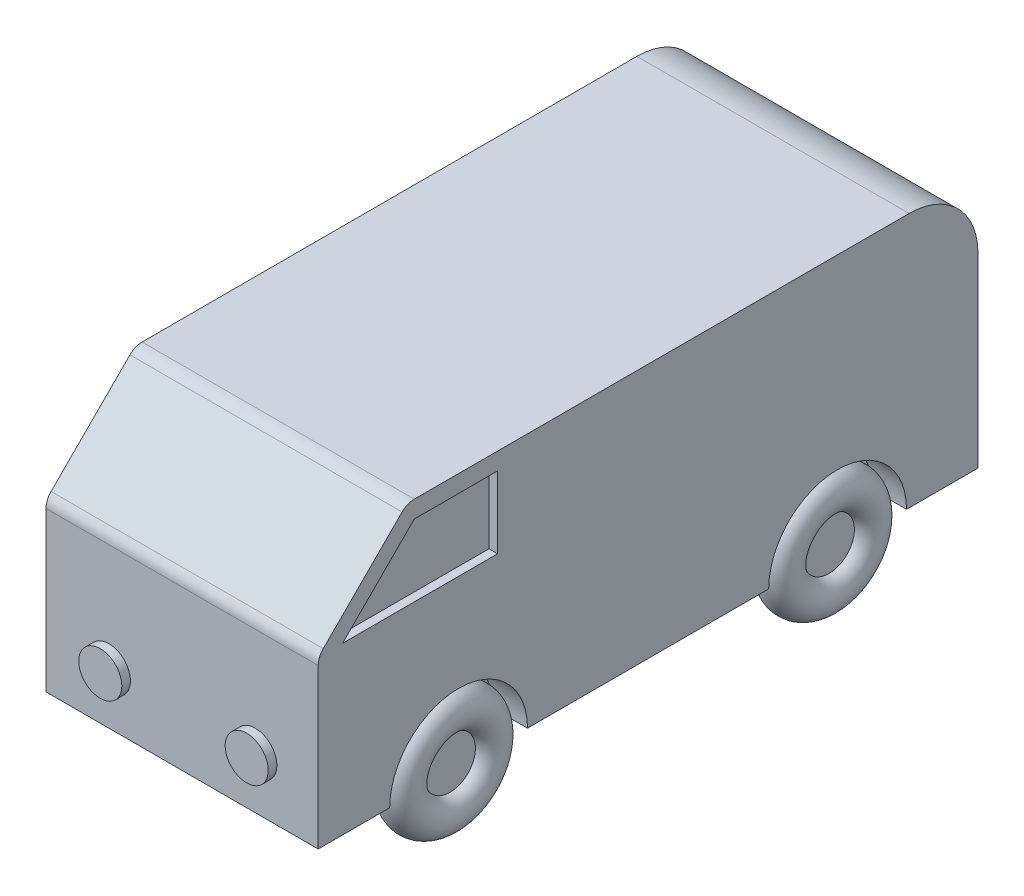
ISO-10303-21;
HEADER;
FILE_DESCRIPTION(('STEP AP214'),'2;1');
FILE_NAME('part.step','',(''),(''),'','','');
FILE_SCHEMA(('AUTOMOTIVE_DESIGN { 1 0 10303 214 1 1 1 1 }'));
ENDSEC;
DATA;
#1=APPLICATION_CONTEXT('core data for automotive mechanical design processes');
#2=APPLICATION_PROTOCOL_DEFINITION('international standard','automotive_design',2000,#1);
#3=PRODUCT_CONTEXT('',#1,'mechanical');
#4=PRODUCT('Part','Part','',(#3));
#5=PRODUCT_RELATED_PRODUCT_CATEGORY('part','',(#4));
#6=PRODUCT_DEFINITION_FORMATION('','',#4);
#7=PRODUCT_DEFINITION_CONTEXT('part definition',#1,'design');
#8=PRODUCT_DEFINITION('design','',#6,#7);
#9=PRODUCT_DEFINITION_SHAPE('','',#8);
#10=(LENGTH_UNIT() NAMED_UNIT(*) SI_UNIT(.MILLI.,.METRE.));
#11=(NAMED_UNIT(*) PLANE_ANGLE_UNIT() SI_UNIT($,.RADIAN.));
#12=(NAMED_UNIT(*) SI_UNIT($,.STERADIAN.) SOLID_ANGLE_UNIT());
#13=UNCERTAINTY_MEASURE_WITH_UNIT(LENGTH_MEASURE(1.E-05),#10,'distance_accuracy_value','');
#14=(GEOMETRIC_REPRESENTATION_CONTEXT(3) GLOBAL_UNCERTAINTY_ASSIGNED_CONTEXT((#13)) GLOBAL_UNIT_ASSIGNED_CONTEXT((#10,
#11,#12)) REPRESENTATION_CONTEXT('',''));
#15=CARTESIAN_POINT('',(0.,0.,0.));
#16=DIRECTION('',(0.,0.,1.));
#17=DIRECTION('',(1.,0.,0.));
#18=AXIS2_PLACEMENT_3D('',#15,#16,#17);
#19=CARTESIAN_POINT('',(79.,108.,-151.5));
#20=DIRECTION('',(1.,0.,0.));
#21=DIRECTION('',(0.,0.,-1.));
#22=AXIS2_PLACEMENT_3D('',#19,#20,#21);
#23=PLANE('',#22);
#24=DIRECTION('',(0.,0.,1.));
#25=VECTOR('',#24,1.);
#26=CARTESIAN_POINT('',(79.,148.,-151.5));
#27=LINE('',#26,#25);
#28=CARTESIAN_POINT('',(79.,148.,-151.5));
#29=VERTEX_POINT('',#28);
#30=CARTESIAN_POINT('',(79.,148.,135.717864376269));
#31=VERTEX_POINT('',#30);
#32=EDGE_CURVE('E381',#29,#31,#27,.T.);
#33=ORIENTED_EDGE('',*,*,#32,.T.);
#34=CARTESIAN_POINT('',(79.,138.,135.717864376269));
#35=DIRECTION('',(1.,0.,0.));
#36=DIRECTION('',(0.,0.,-1.));
#37=AXIS2_PLACEMENT_3D('',#34,#35,#36);
#38=CIRCLE('',#37,10.);
#39=CARTESIAN_POINT('',(79.,145.071067811865,142.788932188134));
#40=VERTEX_POINT('',#39);
#41=EDGE_CURVE('E13',#31,#40,#38,.T.);
#42=ORIENTED_EDGE('',*,*,#41,.T.);
#43=DIRECTION('',(0.,0.707106781186544,-0.707106781186551));
#44=VECTOR('',#43,1.);
#45=CARTESIAN_POINT('',(79.,96.36,191.5));
#46=LINE('',#45,#44);
#47=CARTESIAN_POINT('',(79.,99.2889321881346,188.571067811865));
#48=VERTEX_POINT('',#47);
#49=EDGE_CURVE('E383',#48,#40,#46,.T.);
#50=ORIENTED_EDGE('',*,*,#49,.F.);
#51=CARTESIAN_POINT('',(79.,92.217864376269,181.5));
#52=DIRECTION('',(1.,0.,0.));
#53=DIRECTION('',(0.,0.,-1.));
#54=AXIS2_PLACEMENT_3D('',#51,#52,#53);
#55=CIRCLE('',#54,10.);
#56=CARTESIAN_POINT('',(79.,92.217864376269,191.5));
#57=VERTEX_POINT('',#56);
#58=EDGE_CURVE('E444',#48,#57,#55,.T.);
#59=ORIENTED_EDGE('',*,*,#58,.T.);
#60=DIRECTION('',(0.,-1.,0.));
#61=VECTOR('',#60,1.);
#62=CARTESIAN_POINT('',(79.,96.36,191.5));
#63=LINE('',#62,#61);
#64=CARTESIAN_POINT('',(79.,0.,191.5));
#65=VERTEX_POINT('',#64);
#66=EDGE_CURVE('E369',#57,#65,#63,.T.);
#67=ORIENTED_EDGE('',*,*,#66,.T.);
#68=DIRECTION('',(0.,0.,-1.));
#69=VECTOR('',#68,1.);
#70=CARTESIAN_POINT('',(79.,0.,191.5));
#71=LINE('',#70,#69);
#72=CARTESIAN_POINT('',(79.,0.,150.));
#73=VERTEX_POINT('',#72);
#74=EDGE_CURVE('E373',#65,#73,#71,.T.);
#75=ORIENTED_EDGE('',*,*,#74,.T.);
#76=CARTESIAN_POINT('',(79.,0.,110.));
#77=DIRECTION('',(-1.,0.,0.));
#78=DIRECTION('',(0.,0.,1.));
#79=AXIS2_PLACEMENT_3D('',#76,#77,#78);
#80=CIRCLE('',#79,40.);
#81=CARTESIAN_POINT('',(79.,0.,70.));
#82=VERTEX_POINT('',#81);
#83=EDGE_CURVE('E320',#73,#82,#80,.T.);
#84=ORIENTED_EDGE('',*,*,#83,.T.);
#85=CARTESIAN_POINT('',(79.,0.,-70.));
#86=VERTEX_POINT('',#85);
#87=EDGE_CURVE('E377',#82,#86,#71,.T.);
#88=ORIENTED_EDGE('',*,*,#87,.T.);
#89=CARTESIAN_POINT('',(79.,0.,-110.));
#90=DIRECTION('',(-1.,0.,0.));
#91=DIRECTION('',(0.,0.,1.));
#92=AXIS2_PLACEMENT_3D('',#89,#90,#91);
#93=CIRCLE('',#92,40.);
#94=CARTESIAN_POINT('',(79.,0.,-150.));
#95=VERTEX_POINT('',#94);
#96=EDGE_CURVE('E325',#86,#95,#93,.T.);
#97=ORIENTED_EDGE('',*,*,#96,.T.);
#98=CARTESIAN_POINT('',(79.,0.,-191.5));
#99=VERTEX_POINT('',#98);
#100=EDGE_CURVE('E371',#95,#99,#71,.T.);
#101=ORIENTED_EDGE('',*,*,#100,.T.);
#102=DIRECTION('',(0.,1.,0.));
#103=VECTOR('',#102,1.);
#104=CARTESIAN_POINT('',(79.,0.,-191.5));
#105=LINE('',#104,#103);
#106=CARTESIAN_POINT('',(79.,108.,-191.5));
#107=VERTEX_POINT('',#106);
#108=EDGE_CURVE('E376',#99,#107,#105,.T.);
#109=ORIENTED_EDGE('',*,*,#108,.T.);
#110=CARTESIAN_POINT('',(79.,108.,-151.5));
#111=DIRECTION('',(1.,0.,0.));
#112=DIRECTION('',(0.,0.,-1.));
#113=AXIS2_PLACEMENT_3D('',#110,#111,#112);
#114=CIRCLE('',#113,40.);
#115=EDGE_CURVE('E379',#107,#29,#114,.T.);
#116=ORIENTED_EDGE('',*,*,#115,.T.);
#117=EDGE_LOOP('',(#33,#42,#50,#59,#67,#75,#84,#88,#97,#101,#109,#116));
#118=FACE_BOUND('',#117,.T.);
#119=DIRECTION('',(0.,0.,-1.));
#120=VECTOR('',#119,1.);
#121=CARTESIAN_POINT('',(79.,138.,135.717864376269));
#122=LINE('',#121,#120);
#123=CARTESIAN_POINT('',(79.,138.,135.717864376269));
#124=VERTEX_POINT('',#123);
#125=CARTESIAN_POINT('',(79.,138.,87.3578643762691));
#126=VERTEX_POINT('',#125);
#127=EDGE_CURVE('E249',#124,#126,#122,.T.);
#128=ORIENTED_EDGE('',*,*,#127,.T.);
#129=DIRECTION('',(0.,-1.,0.));
#130=VECTOR('',#129,1.);
#131=CARTESIAN_POINT('',(79.,138.,87.3578643762691));
#132=LINE('',#131,#130);
#133=CARTESIAN_POINT('',(79.,96.36,87.3578643762691));
#134=VERTEX_POINT('',#133);
#135=EDGE_CURVE('E967',#126,#134,#132,.T.);
#136=ORIENTED_EDGE('',*,*,#135,.T.);
#137=DIRECTION('',(0.,0.,1.));
#138=VECTOR('',#137,1.);
#139=CARTESIAN_POINT('',(79.,96.36,87.3578643762691));
#140=LINE('',#139,#138);
#141=CARTESIAN_POINT('',(79.,96.36,177.357864376269));
#142=VERTEX_POINT('',#141);
#143=EDGE_CURVE('E253',#134,#142,#140,.T.);
#144=ORIENTED_EDGE('',*,*,#143,.T.);
#145=DIRECTION('',(0.,0.707106781186547,-0.707106781186548));
#146=VECTOR('',#145,1.);
#147=CARTESIAN_POINT('',(79.,96.36,177.357864376269));
#148=LINE('',#147,#146);
#149=EDGE_CURVE('E962',#142,#124,#148,.T.);
#150=ORIENTED_EDGE('',*,*,#149,.T.);
#151=EDGE_LOOP('',(#128,#136,#144,#150));
#152=FACE_BOUND('',#151,.T.);
#153=ADVANCED_FACE('F46',(#118,#152),#23,.T.);
#154=CARTESIAN_POINT('',(79.,0.,0.));
#155=DIRECTION('',(0.,1.,0.));
#156=DIRECTION('',(0.,0.,1.));
#157=AXIS2_PLACEMENT_3D('',#154,#155,#156);
#158=PLANE('',#157);
#159=DIRECTION('',(1.,0.,0.));
#160=VECTOR('',#159,1.);
#161=CARTESIAN_POINT('',(59.,0.,-70.));
#162=LINE('',#161,#160);
#163=CARTESIAN_POINT('',(59.,0.,-70.));
#164=VERTEX_POINT('',#163);
#165=EDGE_CURVE('E338',#86,#164,#162,.F.);
#166=ORIENTED_EDGE('',*,*,#165,.F.);
#167=ORIENTED_EDGE('',*,*,#87,.F.);
#168=DIRECTION('',(1.,0.,0.));
#169=VECTOR('',#168,1.);
#170=CARTESIAN_POINT('',(59.,0.,70.));
#171=LINE('',#170,#169);
#172=CARTESIAN_POINT('',(59.,0.,70.));
#173=VERTEX_POINT('',#172);
#174=EDGE_CURVE('E324',#173,#82,#171,.T.);
#175=ORIENTED_EDGE('',*,*,#174,.F.);
#176=DIRECTION('',(0.,0.,-1.));
#177=VECTOR('',#176,1.);
#178=CARTESIAN_POINT('',(59.,0.,0.));
#179=LINE('',#178,#177);
#180=CARTESIAN_POINT('',(59.,0.,85.));
#181=VERTEX_POINT('',#180);
#182=EDGE_CURVE('E426',#181,#173,#179,.T.);
#183=ORIENTED_EDGE('',*,*,#182,.F.);
#184=CARTESIAN_POINT('',(59.,0.,135.));
#185=VERTEX_POINT('',#184);
#186=EDGE_CURVE('E432',#185,#181,#179,.T.);
#187=ORIENTED_EDGE('',*,*,#186,.F.);
#188=CARTESIAN_POINT('',(59.,0.,150.));
#189=VERTEX_POINT('',#188);
#190=EDGE_CURVE('E428',#189,#185,#179,.T.);
#191=ORIENTED_EDGE('',*,*,#190,.F.);
#192=DIRECTION('',(1.,0.,0.));
#193=VECTOR('',#192,1.);
#194=CARTESIAN_POINT('',(59.,0.,150.));
#195=LINE('',#194,#193);
#196=EDGE_CURVE('E334',#73,#189,#195,.F.);
#197=ORIENTED_EDGE('',*,*,#196,.F.);
#198=ORIENTED_EDGE('',*,*,#74,.F.);
#199=DIRECTION('',(-1.,0.,0.));
#200=VECTOR('',#199,1.);
#201=CARTESIAN_POINT('',(79.,0.,191.5));
#202=LINE('',#201,#200);
#203=CARTESIAN_POINT('',(-79.,0.,191.5));
#204=VERTEX_POINT('',#203);
#205=EDGE_CURVE('E408',#65,#204,#202,.T.);
#206=ORIENTED_EDGE('',*,*,#205,.T.);
#207=DIRECTION('',(0.,0.,-1.));
#208=VECTOR('',#207,1.);
#209=CARTESIAN_POINT('',(-79.,0.,0.));
#210=LINE('',#209,#208);
#211=CARTESIAN_POINT('',(-79.,0.,150.));
#212=VERTEX_POINT('',#211);
#213=EDGE_CURVE('E389',#204,#212,#210,.T.);
#214=ORIENTED_EDGE('',*,*,#213,.T.);
#215=DIRECTION('',(-1.,0.,0.));
#216=VECTOR('',#215,1.);
#217=CARTESIAN_POINT('',(-59.,0.,150.));
#218=LINE('',#217,#216);
#219=CARTESIAN_POINT('',(-59.,0.,150.));
#220=VERTEX_POINT('',#219);
#221=EDGE_CURVE('E344',#212,#220,#218,.F.);
#222=ORIENTED_EDGE('',*,*,#221,.T.);
#223=DIRECTION('',(0.,0.,1.));
#224=VECTOR('',#223,1.);
#225=CARTESIAN_POINT('',(-59.,0.,0.));
#226=LINE('',#225,#224);
#227=CARTESIAN_POINT('',(-59.,0.,135.));
#228=VERTEX_POINT('',#227);
#229=EDGE_CURVE('E417',#228,#220,#226,.T.);
#230=ORIENTED_EDGE('',*,*,#229,.F.);
#231=CARTESIAN_POINT('',(-59.,0.,85.));
#232=VERTEX_POINT('',#231);
#233=EDGE_CURVE('E422',#232,#228,#226,.T.);
#234=ORIENTED_EDGE('',*,*,#233,.F.);
#235=CARTESIAN_POINT('',(-59.,0.,70.));
#236=VERTEX_POINT('',#235);
#237=EDGE_CURVE('E418',#236,#232,#226,.T.);
#238=ORIENTED_EDGE('',*,*,#237,.F.);
#239=DIRECTION('',(-1.,0.,0.));
#240=VECTOR('',#239,1.);
#241=CARTESIAN_POINT('',(-59.,0.,70.));
#242=LINE('',#241,#240);
#243=CARTESIAN_POINT('',(-79.,0.,70.));
#244=VERTEX_POINT('',#243);
#245=EDGE_CURVE('E353',#236,#244,#242,.T.);
#246=ORIENTED_EDGE('',*,*,#245,.T.);
#247=CARTESIAN_POINT('',(-79.,0.,-70.));
#248=VERTEX_POINT('',#247);
#249=EDGE_CURVE('E393',#244,#248,#210,.T.);
#250=ORIENTED_EDGE('',*,*,#249,.T.);
#251=DIRECTION('',(-1.,0.,0.));
#252=VECTOR('',#251,1.);
#253=CARTESIAN_POINT('',(-59.,0.,-70.));
#254=LINE('',#253,#252);
#255=CARTESIAN_POINT('',(-59.,0.,-70.));
#256=VERTEX_POINT('',#255);
#257=EDGE_CURVE('E356',#248,#256,#254,.F.);
#258=ORIENTED_EDGE('',*,*,#257,.T.);
#259=DIRECTION('',(0.,0.,1.));
#260=VECTOR('',#259,1.);
#261=CARTESIAN_POINT('',(-59.,0.,0.));
#262=LINE('',#261,#260);
#263=CARTESIAN_POINT('',(-59.,0.,-85.));
#264=VERTEX_POINT('',#263);
#265=EDGE_CURVE('E421',#264,#256,#262,.T.);
#266=ORIENTED_EDGE('',*,*,#265,.F.);
#267=CARTESIAN_POINT('',(-59.,0.,-135.));
#268=VERTEX_POINT('',#267);
#269=EDGE_CURVE('E427',#268,#264,#262,.T.);
#270=ORIENTED_EDGE('',*,*,#269,.F.);
#271=CARTESIAN_POINT('',(-59.,0.,-150.));
#272=VERTEX_POINT('',#271);
#273=EDGE_CURVE('E423',#272,#268,#262,.T.);
#274=ORIENTED_EDGE('',*,*,#273,.F.);
#275=DIRECTION('',(-1.,0.,0.));
#276=VECTOR('',#275,1.);
#277=CARTESIAN_POINT('',(-59.,0.,-150.));
#278=LINE('',#277,#276);
#279=CARTESIAN_POINT('',(-79.,0.,-150.));
#280=VERTEX_POINT('',#279);
#281=EDGE_CURVE('E359',#272,#280,#278,.T.);
#282=ORIENTED_EDGE('',*,*,#281,.T.);
#283=CARTESIAN_POINT('',(-79.,0.,-191.5));
#284=VERTEX_POINT('',#283);
#285=EDGE_CURVE('E388',#280,#284,#210,.T.);
#286=ORIENTED_EDGE('',*,*,#285,.T.);
#287=DIRECTION('',(-1.,0.,0.));
#288=VECTOR('',#287,1.);
#289=CARTESIAN_POINT('',(79.,0.,-191.5));
#290=LINE('',#289,#288);
#291=EDGE_CURVE('E405',#99,#284,#290,.T.);
#292=ORIENTED_EDGE('',*,*,#291,.F.);
#293=ORIENTED_EDGE('',*,*,#100,.F.);
#294=DIRECTION('',(1.,0.,0.));
#295=VECTOR('',#294,1.);
#296=CARTESIAN_POINT('',(59.,0.,-150.));
#297=LINE('',#296,#295);
#298=CARTESIAN_POINT('',(59.,0.,-150.));
#299=VERTEX_POINT('',#298);
#300=EDGE_CURVE('E336',#299,#95,#297,.T.);
#301=ORIENTED_EDGE('',*,*,#300,.F.);
#302=DIRECTION('',(0.,0.,-1.));
#303=VECTOR('',#302,1.);
#304=CARTESIAN_POINT('',(59.,0.,0.));
#305=LINE('',#304,#303);
#306=CARTESIAN_POINT('',(59.,0.,-135.));
#307=VERTEX_POINT('',#306);
#308=EDGE_CURVE('E431',#307,#299,#305,.T.);
#309=ORIENTED_EDGE('',*,*,#308,.F.);
#310=CARTESIAN_POINT('',(59.,0.,-85.));
#311=VERTEX_POINT('',#310);
#312=EDGE_CURVE('E437',#311,#307,#305,.T.);
#313=ORIENTED_EDGE('',*,*,#312,.F.);
#314=EDGE_CURVE('E433',#164,#311,#305,.T.);
#315=ORIENTED_EDGE('',*,*,#314,.F.);
#316=EDGE_LOOP('',(#166,#167,#175,#183,#187,#191,#197,#198,#206,#214,#222,#230,#234,#238,#246,
#250,#258,#266,#270,#274,#282,#286,#292,#293,#301,#309,#313,#315));
#317=FACE_BOUND('',#316,.T.);
#318=ADVANCED_FACE('F474',(#317),#158,.F.);
#319=CARTESIAN_POINT('',(79.,96.36,191.5));
#320=DIRECTION('',(0.,0.,-1.));
#321=DIRECTION('',(0.,1.,0.));
#322=AXIS2_PLACEMENT_3D('',#319,#320,#321);
#323=PLANE('',#322);
#324=CARTESIAN_POINT('',(42.5,30.,191.5));
#325=DIRECTION('',(0.,0.,-1.));
#326=DIRECTION('',(0.,1.,0.));
#327=AXIS2_PLACEMENT_3D('',#324,#325,#326);
#328=CIRCLE('',#327,12.5);
#329=CARTESIAN_POINT('',(42.5,42.5,191.5));
#330=VERTEX_POINT('',#329);
#331=EDGE_CURVE('E414',#330,#330,#328,.F.);
#332=ORIENTED_EDGE('',*,*,#331,.F.);
#333=EDGE_LOOP('',(#332));
#334=FACE_BOUND('',#333,.T.);
#335=CARTESIAN_POINT('',(-42.5,30.,191.5));
#336=DIRECTION('',(0.,0.,-1.));
#337=DIRECTION('',(0.,1.,0.));
#338=AXIS2_PLACEMENT_3D('',#335,#336,#337);
#339=CIRCLE('',#338,12.5);
#340=CARTESIAN_POINT('',(-42.5,42.5,191.5));
#341=VERTEX_POINT('',#340);
#342=EDGE_CURVE('E411',#341,#341,#339,.F.);
#343=ORIENTED_EDGE('',*,*,#342,.F.);
#344=EDGE_LOOP('',(#343));
#345=FACE_BOUND('',#344,.T.);
#346=ORIENTED_EDGE('',*,*,#66,.F.);
#347=DIRECTION('',(-1.,0.,0.));
#348=VECTOR('',#347,1.);
#349=CARTESIAN_POINT('',(-79.,92.217864376269,191.5));
#350=LINE('',#349,#348);
#351=CARTESIAN_POINT('',(-79.,92.217864376269,191.5));
#352=VERTEX_POINT('',#351);
#353=EDGE_CURVE('E436',#57,#352,#350,.T.);
#354=ORIENTED_EDGE('',*,*,#353,.T.);
#355=DIRECTION('',(0.,-1.,0.));
#356=VECTOR('',#355,1.);
#357=CARTESIAN_POINT('',(-79.,96.36,191.5));
#358=LINE('',#357,#356);
#359=EDGE_CURVE('E368',#352,#204,#358,.T.);
#360=ORIENTED_EDGE('',*,*,#359,.T.);
#361=ORIENTED_EDGE('',*,*,#205,.F.);
#362=EDGE_LOOP('',(#346,#354,#360,#361));
#363=FACE_BOUND('',#362,.T.);
#364=ADVANCED_FACE('F466',(#334,#345,#363),#323,.F.);
#365=CARTESIAN_POINT('',(79.,0.,-191.5));
#366=DIRECTION('',(0.,0.,1.));
#367=DIRECTION('',(0.,-1.,0.));
#368=AXIS2_PLACEMENT_3D('',#365,#366,#367);
#369=PLANE('',#368);
#370=DIRECTION('',(0.,1.,0.));
#371=VECTOR('',#370,1.);
#372=CARTESIAN_POINT('',(-79.,0.,-191.5));
#373=LINE('',#372,#371);
#374=CARTESIAN_POINT('',(-79.,108.,-191.5));
#375=VERTEX_POINT('',#374);
#376=EDGE_CURVE('E392',#284,#375,#373,.T.);
#377=ORIENTED_EDGE('',*,*,#376,.T.);
#378=DIRECTION('',(-1.,0.,0.));
#379=VECTOR('',#378,1.);
#380=CARTESIAN_POINT('',(79.,108.,-191.5));
#381=LINE('',#380,#379);
#382=EDGE_CURVE('E402',#107,#375,#381,.T.);
#383=ORIENTED_EDGE('',*,*,#382,.F.);
#384=ORIENTED_EDGE('',*,*,#108,.F.);
#385=ORIENTED_EDGE('',*,*,#291,.T.);
#386=EDGE_LOOP('',(#377,#383,#384,#385));
#387=FACE_BOUND('',#386,.T.);
#388=ADVANCED_FACE('F524',(#387),#369,.F.);
#389=CARTESIAN_POINT('',(79.,108.,-151.5));
#390=DIRECTION('',(-1.,0.,0.));
#391=DIRECTION('',(0.,0.,1.));
#392=AXIS2_PLACEMENT_3D('',#389,#390,#391);
#393=CYLINDRICAL_SURFACE('',#392,40.);
#394=CARTESIAN_POINT('',(-79.,108.,-151.5));
#395=DIRECTION('',(1.,0.,0.));
#396=DIRECTION('',(0.,0.,-1.));
#397=AXIS2_PLACEMENT_3D('',#394,#395,#396);
#398=CIRCLE('',#397,40.);
#399=CARTESIAN_POINT('',(-79.,148.,-151.5));
#400=VERTEX_POINT('',#399);
#401=EDGE_CURVE('E395',#375,#400,#398,.T.);
#402=ORIENTED_EDGE('',*,*,#401,.T.);
#403=DIRECTION('',(-1.,0.,0.));
#404=VECTOR('',#403,1.);
#405=CARTESIAN_POINT('',(79.,148.,-151.5));
#406=LINE('',#405,#404);
#407=EDGE_CURVE('E386',#29,#400,#406,.T.);
#408=ORIENTED_EDGE('',*,*,#407,.F.);
#409=ORIENTED_EDGE('',*,*,#115,.F.);
#410=ORIENTED_EDGE('',*,*,#382,.T.);
#411=EDGE_LOOP('',(#402,#408,#409,#410));
#412=FACE_BOUND('',#411,.T.);
#413=ADVANCED_FACE('F521',(#412),#393,.T.);
#414=CARTESIAN_POINT('',(79.,148.,-151.5));
#415=DIRECTION('',(0.,-1.,0.));
#416=DIRECTION('',(0.,0.,-1.));
#417=AXIS2_PLACEMENT_3D('',#414,#415,#416);
#418=PLANE('',#417);
#419=DIRECTION('',(0.,0.,1.));
#420=VECTOR('',#419,1.);
#421=CARTESIAN_POINT('',(-79.,148.,-151.5));
#422=LINE('',#421,#420);
#423=CARTESIAN_POINT('',(-79.,148.,135.717864376269));
#424=VERTEX_POINT('',#423);
#425=EDGE_CURVE('E397',#400,#424,#422,.T.);
#426=ORIENTED_EDGE('',*,*,#425,.T.);
#427=DIRECTION('',(-1.,0.,0.));
#428=VECTOR('',#427,1.);
#429=CARTESIAN_POINT('',(79.,148.,135.717864376269));
#430=LINE('',#429,#428);
#431=EDGE_CURVE('E54',#424,#31,#430,.F.);
#432=ORIENTED_EDGE('',*,*,#431,.T.);
#433=ORIENTED_EDGE('',*,*,#32,.F.);
#434=ORIENTED_EDGE('',*,*,#407,.T.);
#435=EDGE_LOOP('',(#426,#432,#433,#434));
#436=FACE_BOUND('',#435,.T.);
#437=ADVANCED_FACE('F518',(#436),#418,.F.);
#438=CARTESIAN_POINT('',(79.,96.36,191.5));
#439=DIRECTION('',(0.,0.707106781186551,0.707106781186544));
#440=DIRECTION('',(0.,-0.707106781186544,0.707106781186551));
#441=AXIS2_PLACEMENT_3D('',#438,#439,#440);
#442=PLANE('',#441);
#443=ORIENTED_EDGE('',*,*,#49,.T.);
#444=DIRECTION('',(-1.,0.,0.));
#445=VECTOR('',#444,1.);
#446=CARTESIAN_POINT('',(-79.,145.071067811865,142.788932188134));
#447=LINE('',#446,#445);
#448=CARTESIAN_POINT('',(-79.,145.071067811865,142.788932188134));
#449=VERTEX_POINT('',#448);
#450=EDGE_CURVE('E446',#40,#449,#447,.T.);
#451=ORIENTED_EDGE('',*,*,#450,.T.);
#452=DIRECTION('',(0.,0.707106781186544,-0.707106781186551));
#453=VECTOR('',#452,1.);
#454=CARTESIAN_POINT('',(-79.,96.36,191.5));
#455=LINE('',#454,#453);
#456=CARTESIAN_POINT('',(-79.,99.2889321881346,188.571067811865));
#457=VERTEX_POINT('',#456);
#458=EDGE_CURVE('E372',#457,#449,#455,.T.);
#459=ORIENTED_EDGE('',*,*,#458,.F.);
#460=DIRECTION('',(-1.,0.,0.));
#461=VECTOR('',#460,1.);
#462=CARTESIAN_POINT('',(79.,99.2889321881346,188.571067811865));
#463=LINE('',#462,#461);
#464=EDGE_CURVE('E442',#457,#48,#463,.F.);
#465=ORIENTED_EDGE('',*,*,#464,.T.);
#466=EDGE_LOOP('',(#443,#451,#459,#465));
#467=FACE_BOUND('',#466,.T.);
#468=ADVANCED_FACE('F452',(#467),#442,.T.);
#469=CARTESIAN_POINT('',(-79.,108.,-151.5));
#470=DIRECTION('',(1.,0.,0.));
#471=DIRECTION('',(0.,0.,-1.));
#472=AXIS2_PLACEMENT_3D('',#469,#470,#471);
#473=PLANE('',#472);
#474=DIRECTION('',(0.,-1.,0.));
#475=VECTOR('',#474,1.);
#476=CARTESIAN_POINT('',(-79.,96.36,87.3578643762691));
#477=LINE('',#476,#475);
#478=CARTESIAN_POINT('',(-79.,138.,87.3578643762691));
#479=VERTEX_POINT('',#478);
#480=CARTESIAN_POINT('',(-79.,96.36,87.3578643762691));
#481=VERTEX_POINT('',#480);
#482=EDGE_CURVE('E257',#479,#481,#477,.T.);
#483=ORIENTED_EDGE('',*,*,#482,.F.);
#484=DIRECTION('',(0.,0.,-1.));
#485=VECTOR('',#484,1.);
#486=CARTESIAN_POINT('',(-79.,138.,87.3578643762691));
#487=LINE('',#486,#485);
#488=CARTESIAN_POINT('',(-79.,138.,135.717864376269));
#489=VERTEX_POINT('',#488);
#490=EDGE_CURVE('E254',#489,#479,#487,.T.);
#491=ORIENTED_EDGE('',*,*,#490,.F.);
#492=DIRECTION('',(0.,0.707106781186547,-0.707106781186548));
#493=VECTOR('',#492,1.);
#494=CARTESIAN_POINT('',(-79.,138.,135.717864376269));
#495=LINE('',#494,#493);
#496=CARTESIAN_POINT('',(-79.,96.36,177.357864376269));
#497=VERTEX_POINT('',#496);
#498=EDGE_CURVE('E267',#497,#489,#495,.T.);
#499=ORIENTED_EDGE('',*,*,#498,.F.);
#500=DIRECTION('',(0.,0.,1.));
#501=VECTOR('',#500,1.);
#502=CARTESIAN_POINT('',(-79.,96.36,177.357864376269));
#503=LINE('',#502,#501);
#504=EDGE_CURVE('E279',#481,#497,#503,.T.);
#505=ORIENTED_EDGE('',*,*,#504,.F.);
#506=EDGE_LOOP('',(#483,#491,#499,#505));
#507=FACE_BOUND('',#506,.T.);
#508=ORIENTED_EDGE('',*,*,#458,.T.);
#509=CARTESIAN_POINT('',(-79.,138.,135.717864376269));
#510=DIRECTION('',(1.,0.,0.));
#511=DIRECTION('',(0.,0.,-1.));
#512=AXIS2_PLACEMENT_3D('',#509,#510,#511);
#513=CIRCLE('',#512,10.);
#514=EDGE_CURVE('E68',#449,#424,#513,.F.);
#515=ORIENTED_EDGE('',*,*,#514,.T.);
#516=ORIENTED_EDGE('',*,*,#425,.F.);
#517=ORIENTED_EDGE('',*,*,#401,.F.);
#518=ORIENTED_EDGE('',*,*,#376,.F.);
#519=ORIENTED_EDGE('',*,*,#285,.F.);
#520=CARTESIAN_POINT('',(-79.,0.,-110.));
#521=DIRECTION('',(-1.,0.,0.));
#522=DIRECTION('',(0.,0.,1.));
#523=AXIS2_PLACEMENT_3D('',#520,#521,#522);
#524=CIRCLE('',#523,40.);
#525=EDGE_CURVE('E345',#248,#280,#524,.T.);
#526=ORIENTED_EDGE('',*,*,#525,.F.);
#527=ORIENTED_EDGE('',*,*,#249,.F.);
#528=CARTESIAN_POINT('',(-79.,0.,110.));
#529=DIRECTION('',(-1.,0.,0.));
#530=DIRECTION('',(0.,0.,1.));
#531=AXIS2_PLACEMENT_3D('',#528,#529,#530);
#532=CIRCLE('',#531,40.);
#533=EDGE_CURVE('E340',#212,#244,#532,.T.);
#534=ORIENTED_EDGE('',*,*,#533,.F.);
#535=ORIENTED_EDGE('',*,*,#213,.F.);
#536=ORIENTED_EDGE('',*,*,#359,.F.);
#537=CARTESIAN_POINT('',(-79.,92.217864376269,181.5));
#538=DIRECTION('',(1.,0.,0.));
#539=DIRECTION('',(0.,0.,-1.));
#540=AXIS2_PLACEMENT_3D('',#537,#538,#539);
#541=CIRCLE('',#540,10.);
#542=EDGE_CURVE('E440',#352,#457,#541,.F.);
#543=ORIENTED_EDGE('',*,*,#542,.T.);
#544=EDGE_LOOP('',(#508,#515,#516,#517,#518,#519,#526,#527,#534,#535,#536,#543));
#545=FACE_BOUND('',#544,.T.);
#546=ADVANCED_FACE('F457',(#507,#545),#473,.F.);
#547=CARTESIAN_POINT('',(-42.5,30.,196.5));
#548=DIRECTION('',(0.,0.,-1.));
#549=DIRECTION('',(-1.,0.,0.));
#550=AXIS2_PLACEMENT_3D('',#547,#548,#549);
#551=CYLINDRICAL_SURFACE('',#550,12.5);
#552=CARTESIAN_POINT('',(-42.5,30.,196.5));
#553=DIRECTION('',(0.,0.,1.));
#554=DIRECTION('',(1.,0.,0.));
#555=AXIS2_PLACEMENT_3D('',#552,#553,#554);
#556=CIRCLE('',#555,12.5);
#557=CARTESIAN_POINT('',(-30.,30.,196.5));
#558=VERTEX_POINT('',#557);
#559=EDGE_CURVE('E365',#558,#558,#556,.T.);
#560=ORIENTED_EDGE('',*,*,#559,.F.);
#561=EDGE_LOOP('',(#560));
#562=FACE_BOUND('',#561,.T.);
#563=ORIENTED_EDGE('',*,*,#342,.T.);
#564=EDGE_LOOP('',(#563));
#565=FACE_BOUND('',#564,.T.);
#566=ADVANCED_FACE('F511',(#562,#565),#551,.T.);
#567=CARTESIAN_POINT('',(-42.5,30.,196.5));
#568=DIRECTION('',(0.,0.,1.));
#569=DIRECTION('',(1.,0.,0.));
#570=AXIS2_PLACEMENT_3D('',#567,#568,#569);
#571=PLANE('',#570);
#572=ORIENTED_EDGE('',*,*,#559,.T.);
#573=EDGE_LOOP('',(#572));
#574=FACE_BOUND('',#573,.T.);
#575=ADVANCED_FACE('F667',(#574),#571,.T.);
#576=CARTESIAN_POINT('',(42.5,30.,196.5));
#577=DIRECTION('',(0.,0.,-1.));
#578=DIRECTION('',(-1.,0.,0.));
#579=AXIS2_PLACEMENT_3D('',#576,#577,#578);
#580=CYLINDRICAL_SURFACE('',#579,12.5);
#581=CARTESIAN_POINT('',(42.5,30.,196.5));
#582=DIRECTION('',(0.,0.,1.));
#583=DIRECTION('',(1.,0.,0.));
#584=AXIS2_PLACEMENT_3D('',#581,#582,#583);
#585=CIRCLE('',#584,12.5);
#586=CARTESIAN_POINT('',(55.,30.,196.5));
#587=VERTEX_POINT('',#586);
#588=EDGE_CURVE('E362',#587,#587,#585,.T.);
#589=ORIENTED_EDGE('',*,*,#588,.F.);
#590=EDGE_LOOP('',(#589));
#591=FACE_BOUND('',#590,.T.);
#592=ORIENTED_EDGE('',*,*,#331,.T.);
#593=EDGE_LOOP('',(#592));
#594=FACE_BOUND('',#593,.T.);
#595=ADVANCED_FACE('F674',(#591,#594),#580,.T.);
#596=CARTESIAN_POINT('',(42.5,30.,196.5));
#597=DIRECTION('',(0.,0.,1.));
#598=DIRECTION('',(1.,0.,0.));
#599=AXIS2_PLACEMENT_3D('',#596,#597,#598);
#600=PLANE('',#599);
#601=ORIENTED_EDGE('',*,*,#588,.T.);
#602=EDGE_LOOP('',(#601));
#603=FACE_BOUND('',#602,.T.);
#604=ADVANCED_FACE('F681',(#603),#600,.T.);
#605=CARTESIAN_POINT('',(-59.,0.,110.));
#606=DIRECTION('',(-1.,0.,0.));
#607=DIRECTION('',(0.,0.,1.));
#608=AXIS2_PLACEMENT_3D('',#605,#606,#607);
#609=PLANE('',#608);
#610=ORIENTED_EDGE('',*,*,#237,.T.);
#611=CARTESIAN_POINT('',(-59.,0.,110.));
#612=DIRECTION('',(-1.,0.,0.));
#613=DIRECTION('',(0.,0.,1.));
#614=AXIS2_PLACEMENT_3D('',#611,#612,#613);
#615=CIRCLE('',#614,25.);
#616=EDGE_CURVE('E310',#228,#232,#615,.T.);
#617=ORIENTED_EDGE('',*,*,#616,.F.);
#618=ORIENTED_EDGE('',*,*,#229,.T.);
#619=CARTESIAN_POINT('',(-59.,0.,110.));
#620=DIRECTION('',(-1.,0.,0.));
#621=DIRECTION('',(0.,0.,1.));
#622=AXIS2_PLACEMENT_3D('',#619,#620,#621);
#623=CIRCLE('',#622,40.);
#624=EDGE_CURVE('E347',#220,#236,#623,.T.);
#625=ORIENTED_EDGE('',*,*,#624,.T.);
#626=EDGE_LOOP('',(#610,#617,#618,#625));
#627=FACE_BOUND('',#626,.T.);
#628=ADVANCED_FACE('F689',(#627),#609,.T.);
#629=CARTESIAN_POINT('',(-59.,0.,110.));
#630=DIRECTION('',(-1.,0.,0.));
#631=DIRECTION('',(0.,0.,1.));
#632=AXIS2_PLACEMENT_3D('',#629,#630,#631);
#633=CYLINDRICAL_SURFACE('',#632,40.);
#634=ORIENTED_EDGE('',*,*,#624,.F.);
#635=ORIENTED_EDGE('',*,*,#221,.F.);
#636=ORIENTED_EDGE('',*,*,#533,.T.);
#637=ORIENTED_EDGE('',*,*,#245,.F.);
#638=EDGE_LOOP('',(#634,#635,#636,#637));
#639=FACE_BOUND('',#638,.T.);
#640=ADVANCED_FACE('F698',(#639),#633,.F.);
#641=CARTESIAN_POINT('',(-59.,0.,-110.));
#642=DIRECTION('',(-1.,0.,0.));
#643=DIRECTION('',(0.,0.,1.));
#644=AXIS2_PLACEMENT_3D('',#641,#642,#643);
#645=PLANE('',#644);
#646=ORIENTED_EDGE('',*,*,#273,.T.);
#647=CARTESIAN_POINT('',(-59.,0.,-110.));
#648=DIRECTION('',(1.,0.,0.));
#649=DIRECTION('',(0.,0.,-1.));
#650=AXIS2_PLACEMENT_3D('',#647,#648,#649);
#651=CIRCLE('',#650,25.);
#652=EDGE_CURVE('E317',#268,#264,#651,.T.);
#653=ORIENTED_EDGE('',*,*,#652,.T.);
#654=ORIENTED_EDGE('',*,*,#265,.T.);
#655=CARTESIAN_POINT('',(-59.,0.,-110.));
#656=DIRECTION('',(-1.,0.,0.));
#657=DIRECTION('',(0.,0.,1.));
#658=AXIS2_PLACEMENT_3D('',#655,#656,#657);
#659=CIRCLE('',#658,40.);
#660=EDGE_CURVE('E341',#256,#272,#659,.T.);
#661=ORIENTED_EDGE('',*,*,#660,.T.);
#662=EDGE_LOOP('',(#646,#653,#654,#661));
#663=FACE_BOUND('',#662,.T.);
#664=ADVANCED_FACE('F707',(#663),#645,.T.);
#665=CARTESIAN_POINT('',(-59.,0.,-110.));
#666=DIRECTION('',(-1.,0.,0.));
#667=DIRECTION('',(0.,0.,1.));
#668=AXIS2_PLACEMENT_3D('',#665,#666,#667);
#669=CYLINDRICAL_SURFACE('',#668,40.);
#670=ORIENTED_EDGE('',*,*,#660,.F.);
#671=ORIENTED_EDGE('',*,*,#257,.F.);
#672=ORIENTED_EDGE('',*,*,#525,.T.);
#673=ORIENTED_EDGE('',*,*,#281,.F.);
#674=EDGE_LOOP('',(#670,#671,#672,#673));
#675=FACE_BOUND('',#674,.T.);
#676=ADVANCED_FACE('F716',(#675),#669,.F.);
#677=CARTESIAN_POINT('',(59.,0.,110.));
#678=DIRECTION('',(1.,0.,0.));
#679=DIRECTION('',(0.,0.,1.));
#680=AXIS2_PLACEMENT_3D('',#677,#678,#679);
#681=PLANE('',#680);
#682=ORIENTED_EDGE('',*,*,#190,.T.);
#683=CARTESIAN_POINT('',(59.,0.,110.));
#684=DIRECTION('',(-1.,0.,0.));
#685=DIRECTION('',(0.,0.,1.));
#686=AXIS2_PLACEMENT_3D('',#683,#684,#685);
#687=CIRCLE('',#686,25.);
#688=EDGE_CURVE('E296',#185,#181,#687,.T.);
#689=ORIENTED_EDGE('',*,*,#688,.T.);
#690=ORIENTED_EDGE('',*,*,#182,.T.);
#691=CARTESIAN_POINT('',(59.,0.,110.));
#692=DIRECTION('',(-1.,0.,0.));
#693=DIRECTION('',(0.,0.,1.));
#694=AXIS2_PLACEMENT_3D('',#691,#692,#693);
#695=CIRCLE('',#694,40.);
#696=EDGE_CURVE('E328',#189,#173,#695,.T.);
#697=ORIENTED_EDGE('',*,*,#696,.F.);
#698=EDGE_LOOP('',(#682,#689,#690,#697));
#699=FACE_BOUND('',#698,.T.);
#700=ADVANCED_FACE('F482',(#699),#681,.T.);
#701=CARTESIAN_POINT('',(59.,0.,110.));
#702=DIRECTION('',(1.,0.,0.));
#703=DIRECTION('',(0.,0.,-1.));
#704=AXIS2_PLACEMENT_3D('',#701,#702,#703);
#705=CYLINDRICAL_SURFACE('',#704,40.);
#706=ORIENTED_EDGE('',*,*,#196,.T.);
#707=ORIENTED_EDGE('',*,*,#696,.T.);
#708=ORIENTED_EDGE('',*,*,#174,.T.);
#709=ORIENTED_EDGE('',*,*,#83,.F.);
#710=EDGE_LOOP('',(#706,#707,#708,#709));
#711=FACE_BOUND('',#710,.T.);
#712=ADVANCED_FACE('F479',(#711),#705,.F.);
#713=CARTESIAN_POINT('',(59.,0.,-110.));
#714=DIRECTION('',(1.,0.,0.));
#715=DIRECTION('',(0.,0.,1.));
#716=AXIS2_PLACEMENT_3D('',#713,#714,#715);
#717=PLANE('',#716);
#718=ORIENTED_EDGE('',*,*,#314,.T.);
#719=CARTESIAN_POINT('',(59.,0.,-110.));
#720=DIRECTION('',(1.,0.,0.));
#721=DIRECTION('',(0.,0.,-1.));
#722=AXIS2_PLACEMENT_3D('',#719,#720,#721);
#723=CIRCLE('',#722,25.);
#724=EDGE_CURVE('E303',#307,#311,#723,.T.);
#725=ORIENTED_EDGE('',*,*,#724,.F.);
#726=ORIENTED_EDGE('',*,*,#308,.T.);
#727=CARTESIAN_POINT('',(59.,0.,-110.));
#728=DIRECTION('',(-1.,0.,0.));
#729=DIRECTION('',(0.,0.,1.));
#730=AXIS2_PLACEMENT_3D('',#727,#728,#729);
#731=CIRCLE('',#730,40.);
#732=EDGE_CURVE('E321',#164,#299,#731,.T.);
#733=ORIENTED_EDGE('',*,*,#732,.F.);
#734=EDGE_LOOP('',(#718,#725,#726,#733));
#735=FACE_BOUND('',#734,.T.);
#736=ADVANCED_FACE('F740',(#735),#717,.T.);
#737=CARTESIAN_POINT('',(59.,0.,-110.));
#738=DIRECTION('',(1.,0.,0.));
#739=DIRECTION('',(0.,0.,-1.));
#740=AXIS2_PLACEMENT_3D('',#737,#738,#739);
#741=CYLINDRICAL_SURFACE('',#740,40.);
#742=ORIENTED_EDGE('',*,*,#165,.T.);
#743=ORIENTED_EDGE('',*,*,#732,.T.);
#744=ORIENTED_EDGE('',*,*,#300,.T.);
#745=ORIENTED_EDGE('',*,*,#96,.F.);
#746=EDGE_LOOP('',(#742,#743,#744,#745));
#747=FACE_BOUND('',#746,.T.);
#748=ADVANCED_FACE('F746',(#747),#741,.F.);
#749=CARTESIAN_POINT('',(-59.,0.,-110.));
#750=DIRECTION('',(1.,0.,0.));
#751=DIRECTION('',(0.,0.,-1.));
#752=AXIS2_PLACEMENT_3D('',#749,#750,#751);
#753=PLANE('',#752);
#754=ORIENTED_EDGE('',*,*,#269,.T.);
#755=EDGE_CURVE('E316',#264,#268,#651,.T.);
#756=ORIENTED_EDGE('',*,*,#755,.T.);
#757=EDGE_LOOP('',(#754,#756));
#758=FACE_BOUND('',#757,.T.);
#759=ADVANCED_FACE('F754',(#758),#753,.T.);
#760=CARTESIAN_POINT('',(-70.,0.,-110.));
#761=DIRECTION('',(1.,0.,0.));
#762=DIRECTION('',(0.,0.,-1.));
#763=AXIS2_PLACEMENT_3D('',#760,#761,#762);
#764=TOROIDAL_SURFACE('',#763,25.,11.);
#765=CARTESIAN_POINT('',(-74.,0.,-110.));
#766=DIRECTION('',(1.,0.,0.));
#767=DIRECTION('',(0.,0.,-1.));
#768=AXIS2_PLACEMENT_3D('',#765,#766,#767);
#769=CIRCLE('',#768,14.7530492340404);
#770=CARTESIAN_POINT('',(-74.,0.,-124.75304923404));
#771=VERTEX_POINT('',#770);
#772=EDGE_CURVE('E313',#771,#771,#769,.T.);
#773=ORIENTED_EDGE('',*,*,#772,.T.);
#774=EDGE_LOOP('',(#773));
#775=FACE_BOUND('',#774,.T.);
#776=ORIENTED_EDGE('',*,*,#652,.F.);
#777=ORIENTED_EDGE('',*,*,#755,.F.);
#778=EDGE_LOOP('',(#776,#777));
#779=FACE_BOUND('',#778,.T.);
#780=ADVANCED_FACE('F761',(#775,#779),#764,.T.);
#781=CARTESIAN_POINT('',(-74.,0.,-110.));
#782=DIRECTION('',(-1.,0.,0.));
#783=DIRECTION('',(0.,0.,1.));
#784=AXIS2_PLACEMENT_3D('',#781,#782,#783);
#785=PLANE('',#784);
#786=ORIENTED_EDGE('',*,*,#772,.F.);
#787=EDGE_LOOP('',(#786));
#788=FACE_BOUND('',#787,.T.);
#789=ADVANCED_FACE('F769',(#788),#785,.T.);
#790=CARTESIAN_POINT('',(-59.,0.,110.));
#791=DIRECTION('',(1.,0.,0.));
#792=DIRECTION('',(0.,0.,1.));
#793=AXIS2_PLACEMENT_3D('',#790,#791,#792);
#794=PLANE('',#793);
#795=ORIENTED_EDGE('',*,*,#233,.T.);
#796=EDGE_CURVE('E309',#232,#228,#615,.T.);
#797=ORIENTED_EDGE('',*,*,#796,.F.);
#798=EDGE_LOOP('',(#795,#797));
#799=FACE_BOUND('',#798,.T.);
#800=ADVANCED_FACE('F776',(#799),#794,.T.);
#801=CARTESIAN_POINT('',(-70.,0.,110.));
#802=DIRECTION('',(1.,0.,0.));
#803=DIRECTION('',(0.,0.,1.));
#804=AXIS2_PLACEMENT_3D('',#801,#802,#803);
#805=TOROIDAL_SURFACE('',#804,25.,11.);
#806=CARTESIAN_POINT('',(-74.,0.,110.));
#807=DIRECTION('',(-1.,0.,0.));
#808=DIRECTION('',(0.,0.,1.));
#809=AXIS2_PLACEMENT_3D('',#806,#807,#808);
#810=CIRCLE('',#809,14.7530492340404);
#811=CARTESIAN_POINT('',(-74.,0.,124.75304923404));
#812=VERTEX_POINT('',#811);
#813=EDGE_CURVE('E306',#812,#812,#810,.T.);
#814=ORIENTED_EDGE('',*,*,#813,.F.);
#815=EDGE_LOOP('',(#814));
#816=FACE_BOUND('',#815,.T.);
#817=ORIENTED_EDGE('',*,*,#616,.T.);
#818=ORIENTED_EDGE('',*,*,#796,.T.);
#819=EDGE_LOOP('',(#817,#818));
#820=FACE_BOUND('',#819,.T.);
#821=ADVANCED_FACE('F783',(#816,#820),#805,.T.);
#822=CARTESIAN_POINT('',(-74.,0.,110.));
#823=DIRECTION('',(-1.,0.,0.));
#824=DIRECTION('',(0.,0.,-1.));
#825=AXIS2_PLACEMENT_3D('',#822,#823,#824);
#826=PLANE('',#825);
#827=ORIENTED_EDGE('',*,*,#813,.T.);
#828=EDGE_LOOP('',(#827));
#829=FACE_BOUND('',#828,.T.);
#830=ADVANCED_FACE('F791',(#829),#826,.T.);
#831=CARTESIAN_POINT('',(59.,0.,-110.));
#832=DIRECTION('',(-1.,0.,0.));
#833=DIRECTION('',(0.,0.,-1.));
#834=AXIS2_PLACEMENT_3D('',#831,#832,#833);
#835=PLANE('',#834);
#836=ORIENTED_EDGE('',*,*,#312,.T.);
#837=EDGE_CURVE('E302',#311,#307,#723,.T.);
#838=ORIENTED_EDGE('',*,*,#837,.F.);
#839=EDGE_LOOP('',(#836,#838));
#840=FACE_BOUND('',#839,.T.);
#841=ADVANCED_FACE('F799',(#840),#835,.T.);
#842=CARTESIAN_POINT('',(70.,0.,-110.));
#843=DIRECTION('',(-1.,0.,0.));
#844=DIRECTION('',(0.,0.,-1.));
#845=AXIS2_PLACEMENT_3D('',#842,#843,#844);
#846=TOROIDAL_SURFACE('',#845,25.,11.);
#847=CARTESIAN_POINT('',(74.,0.,-110.));
#848=DIRECTION('',(1.,0.,0.));
#849=DIRECTION('',(0.,0.,-1.));
#850=AXIS2_PLACEMENT_3D('',#847,#848,#849);
#851=CIRCLE('',#850,14.7530492340404);
#852=CARTESIAN_POINT('',(74.,0.,-124.75304923404));
#853=VERTEX_POINT('',#852);
#854=EDGE_CURVE('E299',#853,#853,#851,.T.);
#855=ORIENTED_EDGE('',*,*,#854,.F.);
#856=EDGE_LOOP('',(#855));
#857=FACE_BOUND('',#856,.T.);
#858=ORIENTED_EDGE('',*,*,#724,.T.);
#859=ORIENTED_EDGE('',*,*,#837,.T.);
#860=EDGE_LOOP('',(#858,#859));
#861=FACE_BOUND('',#860,.T.);
#862=ADVANCED_FACE('F806',(#857,#861),#846,.T.);
#863=CARTESIAN_POINT('',(74.,0.,-110.));
#864=DIRECTION('',(1.,0.,0.));
#865=DIRECTION('',(0.,0.,1.));
#866=AXIS2_PLACEMENT_3D('',#863,#864,#865);
#867=PLANE('',#866);
#868=ORIENTED_EDGE('',*,*,#854,.T.);
#869=EDGE_LOOP('',(#868));
#870=FACE_BOUND('',#869,.T.);
#871=ADVANCED_FACE('F501',(#870),#867,.T.);
#872=CARTESIAN_POINT('',(59.,0.,110.));
#873=DIRECTION('',(-1.,0.,0.));
#874=DIRECTION('',(0.,0.,1.));
#875=AXIS2_PLACEMENT_3D('',#872,#873,#874);
#876=PLANE('',#875);
#877=ORIENTED_EDGE('',*,*,#186,.T.);
#878=EDGE_CURVE('E295',#181,#185,#687,.T.);
#879=ORIENTED_EDGE('',*,*,#878,.T.);
#880=EDGE_LOOP('',(#877,#879));
#881=FACE_BOUND('',#880,.T.);
#882=ADVANCED_FACE('F487',(#881),#876,.T.);
#883=CARTESIAN_POINT('',(70.,0.,110.));
#884=DIRECTION('',(-1.,0.,0.));
#885=DIRECTION('',(0.,0.,1.));
#886=AXIS2_PLACEMENT_3D('',#883,#884,#885);
#887=TOROIDAL_SURFACE('',#886,25.,11.);
#888=CARTESIAN_POINT('',(74.,0.,110.));
#889=DIRECTION('',(-1.,0.,0.));
#890=DIRECTION('',(0.,0.,1.));
#891=AXIS2_PLACEMENT_3D('',#888,#889,#890);
#892=CIRCLE('',#891,14.7530492340404);
#893=CARTESIAN_POINT('',(74.,0.,124.75304923404));
#894=VERTEX_POINT('',#893);
#895=EDGE_CURVE('E286',#894,#894,#892,.T.);
#896=ORIENTED_EDGE('',*,*,#895,.T.);
#897=EDGE_LOOP('',(#896));
#898=FACE_BOUND('',#897,.T.);
#899=ORIENTED_EDGE('',*,*,#688,.F.);
#900=ORIENTED_EDGE('',*,*,#878,.F.);
#901=EDGE_LOOP('',(#899,#900));
#902=FACE_BOUND('',#901,.T.);
#903=ADVANCED_FACE('F489',(#898,#902),#887,.T.);
#904=CARTESIAN_POINT('',(74.,0.,110.));
#905=DIRECTION('',(1.,0.,0.));
#906=DIRECTION('',(0.,0.,-1.));
#907=AXIS2_PLACEMENT_3D('',#904,#905,#906);
#908=PLANE('',#907);
#909=ORIENTED_EDGE('',*,*,#895,.F.);
#910=EDGE_LOOP('',(#909));
#911=FACE_BOUND('',#910,.T.);
#912=ADVANCED_FACE('F491',(#911),#908,.T.);
#913=CARTESIAN_POINT('',(-74.,138.,87.3578643762691));
#914=DIRECTION('',(0.,1.,0.));
#915=DIRECTION('',(0.,0.,1.));
#916=AXIS2_PLACEMENT_3D('',#913,#914,#915);
#917=PLANE('',#916);
#918=ORIENTED_EDGE('',*,*,#490,.T.);
#919=DIRECTION('',(-1.,0.,0.));
#920=VECTOR('',#919,1.);
#921=CARTESIAN_POINT('',(-74.,138.,87.3578643762691));
#922=LINE('',#921,#920);
#923=CARTESIAN_POINT('',(-74.,138.,87.3578643762691));
#924=VERTEX_POINT('',#923);
#925=EDGE_CURVE('E275',#924,#479,#922,.T.);
#926=ORIENTED_EDGE('',*,*,#925,.F.);
#927=DIRECTION('',(0.,0.,-1.));
#928=VECTOR('',#927,1.);
#929=CARTESIAN_POINT('',(-74.,138.,87.3578643762691));
#930=LINE('',#929,#928);
#931=CARTESIAN_POINT('',(-74.,138.,135.717864376269));
#932=VERTEX_POINT('',#931);
#933=EDGE_CURVE('E263',#932,#924,#930,.T.);
#934=ORIENTED_EDGE('',*,*,#933,.F.);
#935=DIRECTION('',(-1.,0.,0.));
#936=VECTOR('',#935,1.);
#937=CARTESIAN_POINT('',(-74.,138.,135.717864376269));
#938=LINE('',#937,#936);
#939=EDGE_CURVE('E284',#932,#489,#938,.T.);
#940=ORIENTED_EDGE('',*,*,#939,.T.);
#941=EDGE_LOOP('',(#918,#926,#934,#940));
#942=FACE_BOUND('',#941,.T.);
#943=ADVANCED_FACE('F498',(#942),#917,.F.);
#944=CARTESIAN_POINT('',(-74.,138.,135.717864376269));
#945=DIRECTION('',(0.,0.707106781186548,0.707106781186547));
#946=DIRECTION('',(0.,-0.707106781186547,0.707106781186548));
#947=AXIS2_PLACEMENT_3D('',#944,#945,#946);
#948=PLANE('',#947);
#949=ORIENTED_EDGE('',*,*,#498,.T.);
#950=ORIENTED_EDGE('',*,*,#939,.F.);
#951=DIRECTION('',(0.,0.707106781186547,-0.707106781186548));
#952=VECTOR('',#951,1.);
#953=CARTESIAN_POINT('',(-74.,138.,135.717864376269));
#954=LINE('',#953,#952);
#955=CARTESIAN_POINT('',(-74.,96.36,177.357864376269));
#956=VERTEX_POINT('',#955);
#957=EDGE_CURVE('E273',#956,#932,#954,.T.);
#958=ORIENTED_EDGE('',*,*,#957,.F.);
#959=DIRECTION('',(-1.,0.,0.));
#960=VECTOR('',#959,1.);
#961=CARTESIAN_POINT('',(-74.,96.36,177.357864376269));
#962=LINE('',#961,#960);
#963=EDGE_CURVE('E287',#956,#497,#962,.T.);
#964=ORIENTED_EDGE('',*,*,#963,.T.);
#965=EDGE_LOOP('',(#949,#950,#958,#964));
#966=FACE_BOUND('',#965,.T.);
#967=ADVANCED_FACE('F557',(#966),#948,.F.);
#968=CARTESIAN_POINT('',(-74.,96.36,177.357864376269));
#969=DIRECTION('',(0.,-1.,0.));
#970=DIRECTION('',(0.,0.,-1.));
#971=AXIS2_PLACEMENT_3D('',#968,#969,#970);
#972=PLANE('',#971);
#973=ORIENTED_EDGE('',*,*,#504,.T.);
#974=ORIENTED_EDGE('',*,*,#963,.F.);
#975=DIRECTION('',(0.,0.,1.));
#976=VECTOR('',#975,1.);
#977=CARTESIAN_POINT('',(-74.,96.36,177.357864376269));
#978=LINE('',#977,#976);
#979=CARTESIAN_POINT('',(-74.,96.36,87.3578643762691));
#980=VERTEX_POINT('',#979);
#981=EDGE_CURVE('E270',#980,#956,#978,.T.);
#982=ORIENTED_EDGE('',*,*,#981,.F.);
#983=DIRECTION('',(-1.,0.,0.));
#984=VECTOR('',#983,1.);
#985=CARTESIAN_POINT('',(-74.,96.36,87.3578643762691));
#986=LINE('',#985,#984);
#987=EDGE_CURVE('E289',#980,#481,#986,.T.);
#988=ORIENTED_EDGE('',*,*,#987,.T.);
#989=EDGE_LOOP('',(#973,#974,#982,#988));
#990=FACE_BOUND('',#989,.T.);
#991=ADVANCED_FACE('F560',(#990),#972,.F.);
#992=CARTESIAN_POINT('',(-74.,96.36,87.3578643762691));
#993=DIRECTION('',(0.,0.,-1.));
#994=DIRECTION('',(-1.,0.,0.));
#995=AXIS2_PLACEMENT_3D('',#992,#993,#994);
#996=PLANE('',#995);
#997=ORIENTED_EDGE('',*,*,#482,.T.);
#998=ORIENTED_EDGE('',*,*,#987,.F.);
#999=DIRECTION('',(0.,-1.,0.));
#1000=VECTOR('',#999,1.);
#1001=CARTESIAN_POINT('',(-74.,96.36,87.3578643762691));
#1002=LINE('',#1001,#1000);
#1003=EDGE_CURVE('E266',#924,#980,#1002,.T.);
#1004=ORIENTED_EDGE('',*,*,#1003,.F.);
#1005=ORIENTED_EDGE('',*,*,#925,.T.);
#1006=EDGE_LOOP('',(#997,#998,#1004,#1005));
#1007=FACE_BOUND('',#1006,.T.);
#1008=ADVANCED_FACE('F555',(#1007),#996,.F.);
#1009=CARTESIAN_POINT('',(-74.,0.,0.));
#1010=DIRECTION('',(-1.,0.,0.));
#1011=DIRECTION('',(0.,0.,1.));
#1012=AXIS2_PLACEMENT_3D('',#1009,#1010,#1011);
#1013=PLANE('',#1012);
#1014=ORIENTED_EDGE('',*,*,#933,.T.);
#1015=ORIENTED_EDGE('',*,*,#1003,.T.);
#1016=ORIENTED_EDGE('',*,*,#981,.T.);
#1017=ORIENTED_EDGE('',*,*,#957,.T.);
#1018=EDGE_LOOP('',(#1014,#1015,#1016,#1017));
#1019=FACE_BOUND('',#1018,.T.);
#1020=ADVANCED_FACE('F552',(#1019),#1013,.T.);
#1021=CARTESIAN_POINT('',(74.,138.,87.3578643762691));
#1022=DIRECTION('',(0.,0.,1.));
#1023=DIRECTION('',(1.,0.,0.));
#1024=AXIS2_PLACEMENT_3D('',#1021,#1022,#1023);
#1025=PLANE('',#1024);
#1026=ORIENTED_EDGE('',*,*,#135,.F.);
#1027=DIRECTION('',(1.,0.,0.));
#1028=VECTOR('',#1027,1.);
#1029=CARTESIAN_POINT('',(74.,138.,87.3578643762691));
#1030=LINE('',#1029,#1028);
#1031=CARTESIAN_POINT('',(74.,138.,87.3578643762691));
#1032=VERTEX_POINT('',#1031);
#1033=EDGE_CURVE('E248',#1032,#126,#1030,.T.);
#1034=ORIENTED_EDGE('',*,*,#1033,.F.);
#1035=DIRECTION('',(0.,-1.,0.));
#1036=VECTOR('',#1035,1.);
#1037=CARTESIAN_POINT('',(74.,138.,87.3578643762691));
#1038=LINE('',#1037,#1036);
#1039=CARTESIAN_POINT('',(74.,96.36,87.3578643762691));
#1040=VERTEX_POINT('',#1039);
#1041=EDGE_CURVE('E235',#1032,#1040,#1038,.T.);
#1042=ORIENTED_EDGE('',*,*,#1041,.T.);
#1043=DIRECTION('',(1.,0.,0.));
#1044=VECTOR('',#1043,1.);
#1045=CARTESIAN_POINT('',(74.,96.36,87.3578643762691));
#1046=LINE('',#1045,#1044);
#1047=EDGE_CURVE('E245',#1040,#134,#1046,.T.);
#1048=ORIENTED_EDGE('',*,*,#1047,.T.);
#1049=EDGE_LOOP('',(#1026,#1034,#1042,#1048));
#1050=FACE_BOUND('',#1049,.T.);
#1051=ADVANCED_FACE('F244',(#1050),#1025,.T.);
#1052=CARTESIAN_POINT('',(74.,96.36,87.3578643762691));
#1053=DIRECTION('',(0.,1.,0.));
#1054=DIRECTION('',(0.,0.,1.));
#1055=AXIS2_PLACEMENT_3D('',#1052,#1053,#1054);
#1056=PLANE('',#1055);
#1057=ORIENTED_EDGE('',*,*,#143,.F.);
#1058=ORIENTED_EDGE('',*,*,#1047,.F.);
#1059=DIRECTION('',(0.,0.,1.));
#1060=VECTOR('',#1059,1.);
#1061=CARTESIAN_POINT('',(74.,96.36,87.3578643762691));
#1062=LINE('',#1061,#1060);
#1063=CARTESIAN_POINT('',(74.,96.36,177.357864376269));
#1064=VERTEX_POINT('',#1063);
#1065=EDGE_CURVE('E231',#1040,#1064,#1062,.T.);
#1066=ORIENTED_EDGE('',*,*,#1065,.T.);
#1067=DIRECTION('',(1.,0.,0.));
#1068=VECTOR('',#1067,1.);
#1069=CARTESIAN_POINT('',(74.,96.36,177.357864376269));
#1070=LINE('',#1069,#1068);
#1071=EDGE_CURVE('E255',#1064,#142,#1070,.T.);
#1072=ORIENTED_EDGE('',*,*,#1071,.T.);
#1073=EDGE_LOOP('',(#1057,#1058,#1066,#1072));
#1074=FACE_BOUND('',#1073,.T.);
#1075=ADVANCED_FACE('F251',(#1074),#1056,.T.);
#1076=CARTESIAN_POINT('',(74.,96.36,177.357864376269));
#1077=DIRECTION('',(0.,-0.707106781186548,-0.707106781186547));
#1078=DIRECTION('',(0.,0.707106781186547,-0.707106781186548));
#1079=AXIS2_PLACEMENT_3D('',#1076,#1077,#1078);
#1080=PLANE('',#1079);
#1081=ORIENTED_EDGE('',*,*,#149,.F.);
#1082=ORIENTED_EDGE('',*,*,#1071,.F.);
#1083=DIRECTION('',(0.,0.707106781186547,-0.707106781186548));
#1084=VECTOR('',#1083,1.);
#1085=CARTESIAN_POINT('',(74.,96.36,177.357864376269));
#1086=LINE('',#1085,#1084);
#1087=CARTESIAN_POINT('',(74.,138.,135.717864376269));
#1088=VERTEX_POINT('',#1087);
#1089=EDGE_CURVE('E236',#1064,#1088,#1086,.T.);
#1090=ORIENTED_EDGE('',*,*,#1089,.T.);
#1091=DIRECTION('',(1.,0.,0.));
#1092=VECTOR('',#1091,1.);
#1093=CARTESIAN_POINT('',(74.,138.,135.717864376269));
#1094=LINE('',#1093,#1092);
#1095=EDGE_CURVE('E259',#1088,#124,#1094,.T.);
#1096=ORIENTED_EDGE('',*,*,#1095,.T.);
#1097=EDGE_LOOP('',(#1081,#1082,#1090,#1096));
#1098=FACE_BOUND('',#1097,.T.);
#1099=ADVANCED_FACE('F541',(#1098),#1080,.T.);
#1100=CARTESIAN_POINT('',(74.,138.,135.717864376269));
#1101=DIRECTION('',(0.,-1.,0.));
#1102=DIRECTION('',(0.,0.,-1.));
#1103=AXIS2_PLACEMENT_3D('',#1100,#1101,#1102);
#1104=PLANE('',#1103);
#1105=ORIENTED_EDGE('',*,*,#127,.F.);
#1106=ORIENTED_EDGE('',*,*,#1095,.F.);
#1107=DIRECTION('',(0.,0.,-1.));
#1108=VECTOR('',#1107,1.);
#1109=CARTESIAN_POINT('',(74.,138.,135.717864376269));
#1110=LINE('',#1109,#1108);
#1111=EDGE_CURVE('E973',#1088,#1032,#1110,.T.);
#1112=ORIENTED_EDGE('',*,*,#1111,.T.);
#1113=ORIENTED_EDGE('',*,*,#1033,.T.);
#1114=EDGE_LOOP('',(#1105,#1106,#1112,#1113));
#1115=FACE_BOUND('',#1114,.T.);
#1116=ADVANCED_FACE('F536',(#1115),#1104,.T.);
#1117=CARTESIAN_POINT('',(74.,0.,0.));
#1118=DIRECTION('',(-1.,0.,0.));
#1119=DIRECTION('',(0.,0.,1.));
#1120=AXIS2_PLACEMENT_3D('',#1117,#1118,#1119);
#1121=PLANE('',#1120);
#1122=ORIENTED_EDGE('',*,*,#1041,.F.);
#1123=ORIENTED_EDGE('',*,*,#1111,.F.);
#1124=ORIENTED_EDGE('',*,*,#1089,.F.);
#1125=ORIENTED_EDGE('',*,*,#1065,.F.);
#1126=EDGE_LOOP('',(#1122,#1123,#1124,#1125));
#1127=FACE_BOUND('',#1126,.T.);
#1128=ADVANCED_FACE('F233',(#1127),#1121,.F.);
#1129=CARTESIAN_POINT('',(79.,92.217864376269,181.5));
#1130=DIRECTION('',(1.,0.,0.));
#1131=DIRECTION('',(0.,0.,-1.));
#1132=AXIS2_PLACEMENT_3D('',#1129,#1130,#1131);
#1133=CYLINDRICAL_SURFACE('',#1132,10.);
#1134=ORIENTED_EDGE('',*,*,#58,.F.);
#1135=ORIENTED_EDGE('',*,*,#464,.F.);
#1136=ORIENTED_EDGE('',*,*,#542,.F.);
#1137=ORIENTED_EDGE('',*,*,#353,.F.);
#1138=EDGE_LOOP('',(#1134,#1135,#1136,#1137));
#1139=FACE_BOUND('',#1138,.T.);
#1140=ADVANCED_FACE('F463',(#1139),#1133,.T.);
#1141=CARTESIAN_POINT('',(79.,138.,135.717864376269));
#1142=DIRECTION('',(1.,0.,0.));
#1143=DIRECTION('',(0.,0.,-1.));
#1144=AXIS2_PLACEMENT_3D('',#1141,#1142,#1143);
#1145=CYLINDRICAL_SURFACE('',#1144,10.);
#1146=ORIENTED_EDGE('',*,*,#41,.F.);
#1147=ORIENTED_EDGE('',*,*,#431,.F.);
#1148=ORIENTED_EDGE('',*,*,#514,.F.);
#1149=ORIENTED_EDGE('',*,*,#450,.F.);
#1150=EDGE_LOOP('',(#1146,#1147,#1148,#1149));
#1151=FACE_BOUND('',#1150,.T.);
#1152=ADVANCED_FACE('F48',(#1151),#1145,.T.);
#1153=CLOSED_SHELL('',(#153,#318,#364,#388,#413,#437,#468,#546,#566,#575,#595,#604,#628,#640,
#664,#676,#700,#712,#736,#748,#759,#780,#789,#800,#821,#830,#841,#862,#871,#882,#903,#912,#943,
#967,#991,#1008,#1020,#1051,#1075,#1099,#1116,#1128,#1140,#1152));
#1154=MANIFOLD_SOLID_BREP('B2',#1153);
#1155=ADVANCED_BREP_SHAPE_REPRESENTATION('',(#18,#1154),#14);
#1156=SHAPE_DEFINITION_REPRESENTATION(#9,#1155);
ENDSEC;
END-ISO-10303-21;
